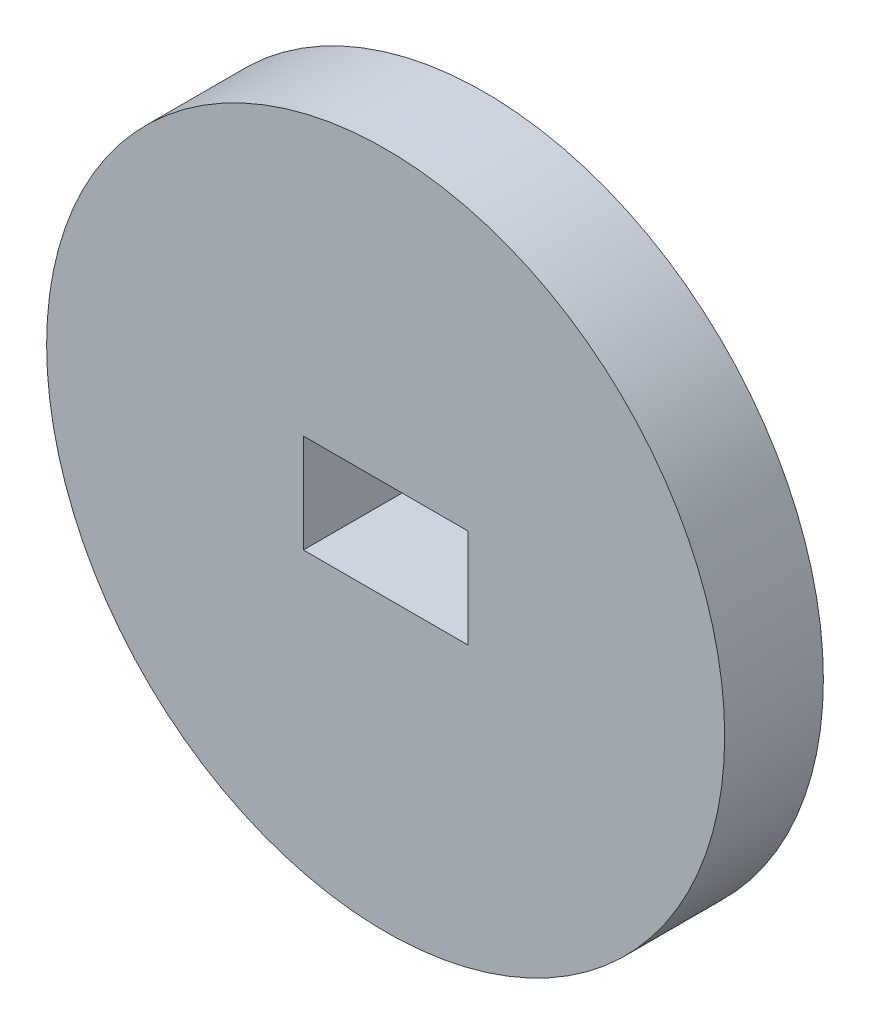
ISO-10303-21;
HEADER;
FILE_DESCRIPTION(('STEP AP214'),'2;1');
FILE_NAME('part.step','',(''),(''),'','','');
FILE_SCHEMA(('AUTOMOTIVE_DESIGN { 1 0 10303 214 1 1 1 1 }'));
ENDSEC;
DATA;
#1=APPLICATION_CONTEXT('core data for automotive mechanical design processes');
#2=APPLICATION_PROTOCOL_DEFINITION('international standard','automotive_design',2000,#1);
#3=PRODUCT_CONTEXT('',#1,'mechanical');
#4=PRODUCT('Part','Part','',(#3));
#5=PRODUCT_RELATED_PRODUCT_CATEGORY('part','',(#4));
#6=PRODUCT_DEFINITION_FORMATION('','',#4);
#7=PRODUCT_DEFINITION_CONTEXT('part definition',#1,'design');
#8=PRODUCT_DEFINITION('design','',#6,#7);
#9=PRODUCT_DEFINITION_SHAPE('','',#8);
#10=(LENGTH_UNIT() NAMED_UNIT(*) SI_UNIT(.MILLI.,.METRE.));
#11=(NAMED_UNIT(*) PLANE_ANGLE_UNIT() SI_UNIT($,.RADIAN.));
#12=(NAMED_UNIT(*) SI_UNIT($,.STERADIAN.) SOLID_ANGLE_UNIT());
#13=UNCERTAINTY_MEASURE_WITH_UNIT(LENGTH_MEASURE(1.E-05),#10,'distance_accuracy_value','');
#14=(GEOMETRIC_REPRESENTATION_CONTEXT(3) GLOBAL_UNCERTAINTY_ASSIGNED_CONTEXT((#13)) GLOBAL_UNIT_ASSIGNED_CONTEXT((#10,
#11,#12)) REPRESENTATION_CONTEXT('',''));
#15=CARTESIAN_POINT('',(0.,0.,0.));
#16=DIRECTION('',(0.,0.,1.));
#17=DIRECTION('',(1.,0.,0.));
#18=AXIS2_PLACEMENT_3D('',#15,#16,#17);
#19=CARTESIAN_POINT('',(0.,-1.5,4.));
#20=DIRECTION('',(0.,-1.,0.));
#21=DIRECTION('',(1.,0.,0.));
#22=AXIS2_PLACEMENT_3D('',#19,#20,#21);
#23=PLANE('',#22);
#24=DIRECTION('',(-1.,0.,0.));
#25=VECTOR('',#24,1.);
#26=CARTESIAN_POINT('',(0.,-1.5,1.));
#27=LINE('',#26,#25);
#28=CARTESIAN_POINT('',(2.5,-1.5,1.));
#29=VERTEX_POINT('',#28);
#30=CARTESIAN_POINT('',(-2.5,-1.5,1.));
#31=VERTEX_POINT('',#30);
#32=EDGE_CURVE('E102',#29,#31,#27,.T.);
#33=ORIENTED_EDGE('',*,*,#32,.T.);
#34=DIRECTION('',(0.,0.,-1.));
#35=VECTOR('',#34,1.);
#36=CARTESIAN_POINT('',(-2.5,-1.5,4.));
#37=LINE('',#36,#35);
#38=CARTESIAN_POINT('',(-2.5,-1.5,4.));
#39=VERTEX_POINT('',#38);
#40=EDGE_CURVE('E11',#39,#31,#37,.T.);
#41=ORIENTED_EDGE('',*,*,#40,.F.);
#42=DIRECTION('',(-1.,0.,0.));
#43=VECTOR('',#42,1.);
#44=CARTESIAN_POINT('',(0.,-1.5,4.));
#45=LINE('',#44,#43);
#46=CARTESIAN_POINT('',(2.5,-1.5,4.));
#47=VERTEX_POINT('',#46);
#48=EDGE_CURVE('E85',#47,#39,#45,.T.);
#49=ORIENTED_EDGE('',*,*,#48,.F.);
#50=DIRECTION('',(0.,0.,-1.));
#51=VECTOR('',#50,1.);
#52=CARTESIAN_POINT('',(2.5,-1.5,4.));
#53=LINE('',#52,#51);
#54=EDGE_CURVE('E51',#47,#29,#53,.T.);
#55=ORIENTED_EDGE('',*,*,#54,.T.);
#56=EDGE_LOOP('',(#33,#41,#49,#55));
#57=FACE_BOUND('',#56,.T.);
#58=ADVANCED_FACE('F35',(#57),#23,.F.);
#59=CARTESIAN_POINT('',(-2.5,0.,4.));
#60=DIRECTION('',(-1.,0.,0.));
#61=DIRECTION('',(0.,0.,1.));
#62=AXIS2_PLACEMENT_3D('',#59,#60,#61);
#63=PLANE('',#62);
#64=DIRECTION('',(0.,1.,0.));
#65=VECTOR('',#64,1.);
#66=CARTESIAN_POINT('',(-2.5,0.,1.));
#67=LINE('',#66,#65);
#68=CARTESIAN_POINT('',(-2.5,1.5,1.));
#69=VERTEX_POINT('',#68);
#70=EDGE_CURVE('E90',#31,#69,#67,.T.);
#71=ORIENTED_EDGE('',*,*,#70,.T.);
#72=DIRECTION('',(0.,0.,-1.));
#73=VECTOR('',#72,1.);
#74=CARTESIAN_POINT('',(-2.5,1.5,4.));
#75=LINE('',#74,#73);
#76=CARTESIAN_POINT('',(-2.5,1.5,4.));
#77=VERTEX_POINT('',#76);
#78=EDGE_CURVE('E43',#77,#69,#75,.T.);
#79=ORIENTED_EDGE('',*,*,#78,.F.);
#80=DIRECTION('',(0.,1.,0.));
#81=VECTOR('',#80,1.);
#82=CARTESIAN_POINT('',(-2.5,0.,4.));
#83=LINE('',#82,#81);
#84=EDGE_CURVE('E76',#39,#77,#83,.T.);
#85=ORIENTED_EDGE('',*,*,#84,.F.);
#86=ORIENTED_EDGE('',*,*,#40,.T.);
#87=EDGE_LOOP('',(#71,#79,#85,#86));
#88=FACE_BOUND('',#87,.T.);
#89=ADVANCED_FACE('F89',(#88),#63,.F.);
#90=CARTESIAN_POINT('',(0.,1.5,4.));
#91=DIRECTION('',(0.,-1.,0.));
#92=DIRECTION('',(1.,0.,0.));
#93=AXIS2_PLACEMENT_3D('',#90,#91,#92);
#94=PLANE('',#93);
#95=DIRECTION('',(-1.,0.,0.));
#96=VECTOR('',#95,1.);
#97=CARTESIAN_POINT('',(0.,1.5,1.));
#98=LINE('',#97,#96);
#99=CARTESIAN_POINT('',(2.5,1.5,1.));
#100=VERTEX_POINT('',#99);
#101=EDGE_CURVE('E105',#100,#69,#98,.T.);
#102=ORIENTED_EDGE('',*,*,#101,.F.);
#103=DIRECTION('',(0.,0.,-1.));
#104=VECTOR('',#103,1.);
#105=CARTESIAN_POINT('',(2.5,1.5,4.));
#106=LINE('',#105,#104);
#107=CARTESIAN_POINT('',(2.5,1.5,4.));
#108=VERTEX_POINT('',#107);
#109=EDGE_CURVE('E65',#108,#100,#106,.T.);
#110=ORIENTED_EDGE('',*,*,#109,.F.);
#111=DIRECTION('',(-1.,0.,0.));
#112=VECTOR('',#111,1.);
#113=CARTESIAN_POINT('',(0.,1.5,4.));
#114=LINE('',#113,#112);
#115=EDGE_CURVE('E84',#108,#77,#114,.T.);
#116=ORIENTED_EDGE('',*,*,#115,.T.);
#117=ORIENTED_EDGE('',*,*,#78,.T.);
#118=EDGE_LOOP('',(#102,#110,#116,#117));
#119=FACE_BOUND('',#118,.T.);
#120=ADVANCED_FACE('F93',(#119),#94,.T.);
#121=CARTESIAN_POINT('',(2.5,0.,4.));
#122=DIRECTION('',(-1.,0.,0.));
#123=DIRECTION('',(0.,0.,1.));
#124=AXIS2_PLACEMENT_3D('',#121,#122,#123);
#125=PLANE('',#124);
#126=DIRECTION('',(0.,1.,0.));
#127=VECTOR('',#126,1.);
#128=CARTESIAN_POINT('',(2.5,0.,1.));
#129=LINE('',#128,#127);
#130=EDGE_CURVE('E107',#29,#100,#129,.T.);
#131=ORIENTED_EDGE('',*,*,#130,.F.);
#132=ORIENTED_EDGE('',*,*,#54,.F.);
#133=DIRECTION('',(0.,1.,0.));
#134=VECTOR('',#133,1.);
#135=CARTESIAN_POINT('',(2.5,0.,4.));
#136=LINE('',#135,#134);
#137=EDGE_CURVE('E94',#47,#108,#136,.T.);
#138=ORIENTED_EDGE('',*,*,#137,.T.);
#139=ORIENTED_EDGE('',*,*,#109,.T.);
#140=EDGE_LOOP('',(#131,#132,#138,#139));
#141=FACE_BOUND('',#140,.T.);
#142=ADVANCED_FACE('F131',(#141),#125,.T.);
#143=CARTESIAN_POINT('',(0.,0.,4.));
#144=DIRECTION('',(0.,0.,-1.));
#145=DIRECTION('',(-1.,0.,0.));
#146=AXIS2_PLACEMENT_3D('',#143,#144,#145);
#147=CYLINDRICAL_SURFACE('',#146,10.30551588);
#148=CARTESIAN_POINT('',(0.,0.,4.));
#149=DIRECTION('',(0.,0.,1.));
#150=DIRECTION('',(1.,0.,0.));
#151=AXIS2_PLACEMENT_3D('',#148,#149,#150);
#152=CIRCLE('',#151,10.30551588);
#153=CARTESIAN_POINT('',(10.30551588,0.,4.));
#154=VERTEX_POINT('',#153);
#155=EDGE_CURVE('E96',#154,#154,#152,.T.);
#156=ORIENTED_EDGE('',*,*,#155,.F.);
#157=EDGE_LOOP('',(#156));
#158=FACE_BOUND('',#157,.T.);
#159=CARTESIAN_POINT('',(0.,0.,1.));
#160=DIRECTION('',(0.,0.,1.));
#161=DIRECTION('',(1.,0.,0.));
#162=AXIS2_PLACEMENT_3D('',#159,#160,#161);
#163=CIRCLE('',#162,10.30551588);
#164=CARTESIAN_POINT('',(10.30551588,0.,1.));
#165=VERTEX_POINT('',#164);
#166=EDGE_CURVE('E110',#165,#165,#163,.T.);
#167=ORIENTED_EDGE('',*,*,#166,.T.);
#168=EDGE_LOOP('',(#167));
#169=FACE_BOUND('',#168,.T.);
#170=ADVANCED_FACE('F116',(#158,#169),#147,.T.);
#171=CARTESIAN_POINT('',(0.,0.,4.));
#172=DIRECTION('',(0.,0.,1.));
#173=DIRECTION('',(1.,0.,0.));
#174=AXIS2_PLACEMENT_3D('',#171,#172,#173);
#175=PLANE('',#174);
#176=ORIENTED_EDGE('',*,*,#48,.T.);
#177=ORIENTED_EDGE('',*,*,#84,.T.);
#178=ORIENTED_EDGE('',*,*,#115,.F.);
#179=ORIENTED_EDGE('',*,*,#137,.F.);
#180=EDGE_LOOP('',(#176,#177,#178,#179));
#181=FACE_BOUND('',#180,.T.);
#182=ORIENTED_EDGE('',*,*,#155,.T.);
#183=EDGE_LOOP('',(#182));
#184=FACE_BOUND('',#183,.T.);
#185=ADVANCED_FACE('F80',(#181,#184),#175,.T.);
#186=CARTESIAN_POINT('',(0.,0.,1.));
#187=DIRECTION('',(0.,0.,1.));
#188=DIRECTION('',(1.,0.,0.));
#189=AXIS2_PLACEMENT_3D('',#186,#187,#188);
#190=PLANE('',#189);
#191=ORIENTED_EDGE('',*,*,#32,.F.);
#192=ORIENTED_EDGE('',*,*,#130,.T.);
#193=ORIENTED_EDGE('',*,*,#101,.T.);
#194=ORIENTED_EDGE('',*,*,#70,.F.);
#195=EDGE_LOOP('',(#191,#192,#193,#194));
#196=FACE_BOUND('',#195,.T.);
#197=ORIENTED_EDGE('',*,*,#166,.F.);
#198=EDGE_LOOP('',(#197));
#199=FACE_BOUND('',#198,.T.);
#200=ADVANCED_FACE('F118',(#196,#199),#190,.F.);
#201=CLOSED_SHELL('',(#58,#89,#120,#142,#170,#185,#200));
#202=MANIFOLD_SOLID_BREP('B2',#201);
#203=ADVANCED_BREP_SHAPE_REPRESENTATION('',(#18,#202),#14);
#204=SHAPE_DEFINITION_REPRESENTATION(#9,#203);
ENDSEC;
END-ISO-10303-21;
